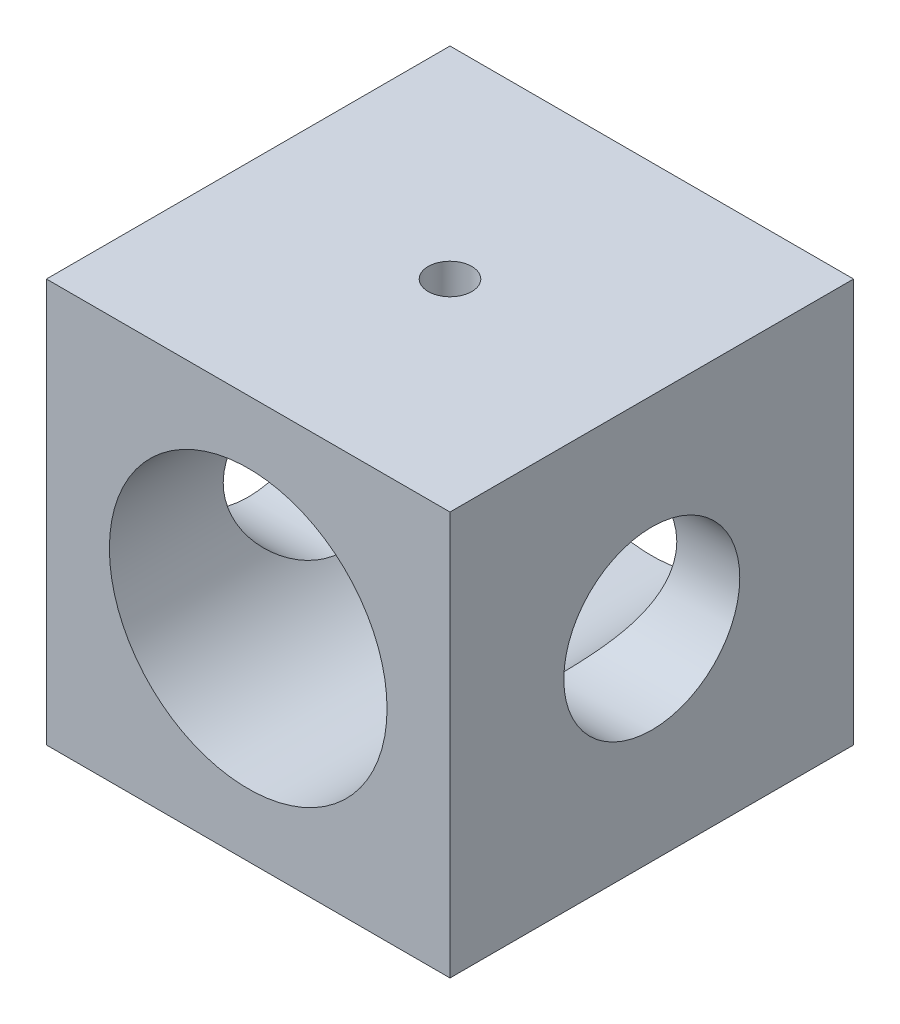
ISO-10303-21;
HEADER;
FILE_DESCRIPTION(('STEP AP214'),'2;1');
FILE_NAME('part.step','',(''),(''),'','','');
FILE_SCHEMA(('AUTOMOTIVE_DESIGN { 1 0 10303 214 1 1 1 1 }'));
ENDSEC;
DATA;
#1=APPLICATION_CONTEXT('core data for automotive mechanical design processes');
#2=APPLICATION_PROTOCOL_DEFINITION('international standard','automotive_design',2000,#1);
#3=PRODUCT_CONTEXT('',#1,'mechanical');
#4=PRODUCT('Part','Part','',(#3));
#5=PRODUCT_RELATED_PRODUCT_CATEGORY('part','',(#4));
#6=PRODUCT_DEFINITION_FORMATION('','',#4);
#7=PRODUCT_DEFINITION_CONTEXT('part definition',#1,'design');
#8=PRODUCT_DEFINITION('design','',#6,#7);
#9=PRODUCT_DEFINITION_SHAPE('','',#8);
#10=(LENGTH_UNIT() NAMED_UNIT(*) SI_UNIT(.MILLI.,.METRE.));
#11=(NAMED_UNIT(*) PLANE_ANGLE_UNIT() SI_UNIT($,.RADIAN.));
#12=(NAMED_UNIT(*) SI_UNIT($,.STERADIAN.) SOLID_ANGLE_UNIT());
#13=UNCERTAINTY_MEASURE_WITH_UNIT(LENGTH_MEASURE(1.E-05),#10,'distance_accuracy_value','');
#14=(GEOMETRIC_REPRESENTATION_CONTEXT(3) GLOBAL_UNCERTAINTY_ASSIGNED_CONTEXT((#13)) GLOBAL_UNIT_ASSIGNED_CONTEXT((#10,
#11,#12)) REPRESENTATION_CONTEXT('',''));
#15=CARTESIAN_POINT('',(0.,0.,0.));
#16=DIRECTION('',(0.,0.,1.));
#17=DIRECTION('',(1.,0.,0.));
#18=AXIS2_PLACEMENT_3D('',#15,#16,#17);
#19=CARTESIAN_POINT('',(12.5,25.,12.5));
#20=DIRECTION('',(-1.,0.,0.));
#21=DIRECTION('',(0.,0.,1.));
#22=AXIS2_PLACEMENT_3D('',#19,#20,#21);
#23=PLANE('',#22);
#24=CARTESIAN_POINT('',(12.5,12.5,0.));
#25=DIRECTION('',(-1.,0.,0.));
#26=DIRECTION('',(0.,0.,1.));
#27=AXIS2_PLACEMENT_3D('',#24,#25,#26);
#28=CIRCLE('',#27,5.45);
#29=CARTESIAN_POINT('',(12.5,12.5,5.45));
#30=VERTEX_POINT('',#29);
#31=EDGE_CURVE('E135',#30,#30,#28,.T.);
#32=ORIENTED_EDGE('',*,*,#31,.T.);
#33=EDGE_LOOP('',(#32));
#34=FACE_BOUND('',#33,.T.);
#35=DIRECTION('',(0.,0.,-1.));
#36=VECTOR('',#35,1.);
#37=CARTESIAN_POINT('',(12.5,0.,12.5));
#38=LINE('',#37,#36);
#39=CARTESIAN_POINT('',(12.5,0.,12.5));
#40=VERTEX_POINT('',#39);
#41=CARTESIAN_POINT('',(12.5,0.,-12.5));
#42=VERTEX_POINT('',#41);
#43=EDGE_CURVE('E115',#40,#42,#38,.T.);
#44=ORIENTED_EDGE('',*,*,#43,.T.);
#45=DIRECTION('',(0.,-1.,0.));
#46=VECTOR('',#45,1.);
#47=CARTESIAN_POINT('',(12.5,25.,-12.5));
#48=LINE('',#47,#46);
#49=CARTESIAN_POINT('',(12.5,25.,-12.5));
#50=VERTEX_POINT('',#49);
#51=EDGE_CURVE('E11',#50,#42,#48,.T.);
#52=ORIENTED_EDGE('',*,*,#51,.F.);
#53=DIRECTION('',(0.,0.,-1.));
#54=VECTOR('',#53,1.);
#55=CARTESIAN_POINT('',(12.5,25.,12.5));
#56=LINE('',#55,#54);
#57=CARTESIAN_POINT('',(12.5,25.,12.5));
#58=VERTEX_POINT('',#57);
#59=EDGE_CURVE('E98',#58,#50,#56,.T.);
#60=ORIENTED_EDGE('',*,*,#59,.F.);
#61=DIRECTION('',(0.,-1.,0.));
#62=VECTOR('',#61,1.);
#63=CARTESIAN_POINT('',(12.5,25.,12.5));
#64=LINE('',#63,#62);
#65=EDGE_CURVE('E111',#58,#40,#64,.T.);
#66=ORIENTED_EDGE('',*,*,#65,.T.);
#67=EDGE_LOOP('',(#44,#52,#60,#66));
#68=FACE_BOUND('',#67,.T.);
#69=ADVANCED_FACE('F39',(#34,#68),#23,.F.);
#70=CARTESIAN_POINT('',(-12.5,25.,-12.5));
#71=DIRECTION('',(0.,0.,1.));
#72=DIRECTION('',(1.,0.,0.));
#73=AXIS2_PLACEMENT_3D('',#70,#71,#72);
#74=PLANE('',#73);
#75=CARTESIAN_POINT('',(0.,12.5,-12.5));
#76=DIRECTION('',(0.,0.,1.));
#77=DIRECTION('',(1.,0.,0.));
#78=AXIS2_PLACEMENT_3D('',#75,#76,#77);
#79=CIRCLE('',#78,8.6);
#80=CARTESIAN_POINT('',(8.6,12.5,-12.5));
#81=VERTEX_POINT('',#80);
#82=EDGE_CURVE('E119',#81,#81,#79,.F.);
#83=ORIENTED_EDGE('',*,*,#82,.F.);
#84=EDGE_LOOP('',(#83));
#85=FACE_BOUND('',#84,.T.);
#86=DIRECTION('',(-1.,0.,0.));
#87=VECTOR('',#86,1.);
#88=CARTESIAN_POINT('',(-12.5,0.,-12.5));
#89=LINE('',#88,#87);
#90=CARTESIAN_POINT('',(-12.5,0.,-12.5));
#91=VERTEX_POINT('',#90);
#92=EDGE_CURVE('E103',#42,#91,#89,.T.);
#93=ORIENTED_EDGE('',*,*,#92,.T.);
#94=DIRECTION('',(0.,-1.,0.));
#95=VECTOR('',#94,1.);
#96=CARTESIAN_POINT('',(-12.5,25.,-12.5));
#97=LINE('',#96,#95);
#98=CARTESIAN_POINT('',(-12.5,25.,-12.5));
#99=VERTEX_POINT('',#98);
#100=EDGE_CURVE('E54',#99,#91,#97,.T.);
#101=ORIENTED_EDGE('',*,*,#100,.F.);
#102=DIRECTION('',(-1.,0.,0.));
#103=VECTOR('',#102,1.);
#104=CARTESIAN_POINT('',(-12.5,25.,-12.5));
#105=LINE('',#104,#103);
#106=EDGE_CURVE('E93',#50,#99,#105,.T.);
#107=ORIENTED_EDGE('',*,*,#106,.F.);
#108=ORIENTED_EDGE('',*,*,#51,.T.);
#109=EDGE_LOOP('',(#93,#101,#107,#108));
#110=FACE_BOUND('',#109,.T.);
#111=ADVANCED_FACE('F102',(#85,#110),#74,.F.);
#112=CARTESIAN_POINT('',(-12.5,25.,12.5));
#113=DIRECTION('',(1.,0.,0.));
#114=DIRECTION('',(0.,0.,-1.));
#115=AXIS2_PLACEMENT_3D('',#112,#113,#114);
#116=PLANE('',#115);
#117=CARTESIAN_POINT('',(-12.5,12.5,0.));
#118=DIRECTION('',(-1.,0.,0.));
#119=DIRECTION('',(0.,0.,1.));
#120=AXIS2_PLACEMENT_3D('',#117,#118,#119);
#121=CIRCLE('',#120,5.45);
#122=CARTESIAN_POINT('',(-12.5,12.5,5.45));
#123=VERTEX_POINT('',#122);
#124=EDGE_CURVE('E160',#123,#123,#121,.T.);
#125=ORIENTED_EDGE('',*,*,#124,.F.);
#126=EDGE_LOOP('',(#125));
#127=FACE_BOUND('',#126,.T.);
#128=DIRECTION('',(0.,0.,1.));
#129=VECTOR('',#128,1.);
#130=CARTESIAN_POINT('',(-12.5,0.,12.5));
#131=LINE('',#130,#129);
#132=CARTESIAN_POINT('',(-12.5,0.,12.5));
#133=VERTEX_POINT('',#132);
#134=EDGE_CURVE('E80',#91,#133,#131,.T.);
#135=ORIENTED_EDGE('',*,*,#134,.T.);
#136=DIRECTION('',(0.,-1.,0.));
#137=VECTOR('',#136,1.);
#138=CARTESIAN_POINT('',(-12.5,25.,12.5));
#139=LINE('',#138,#137);
#140=CARTESIAN_POINT('',(-12.5,25.,12.5));
#141=VERTEX_POINT('',#140);
#142=EDGE_CURVE('E105',#141,#133,#139,.T.);
#143=ORIENTED_EDGE('',*,*,#142,.F.);
#144=DIRECTION('',(0.,0.,1.));
#145=VECTOR('',#144,1.);
#146=CARTESIAN_POINT('',(-12.5,25.,12.5));
#147=LINE('',#146,#145);
#148=EDGE_CURVE('E96',#99,#141,#147,.T.);
#149=ORIENTED_EDGE('',*,*,#148,.F.);
#150=ORIENTED_EDGE('',*,*,#100,.T.);
#151=EDGE_LOOP('',(#135,#143,#149,#150));
#152=FACE_BOUND('',#151,.T.);
#153=ADVANCED_FACE('F107',(#127,#152),#116,.F.);
#154=CARTESIAN_POINT('',(-12.5,25.,12.5));
#155=DIRECTION('',(0.,0.,-1.));
#156=DIRECTION('',(-1.,0.,0.));
#157=AXIS2_PLACEMENT_3D('',#154,#155,#156);
#158=PLANE('',#157);
#159=CARTESIAN_POINT('',(0.,12.5,12.5));
#160=DIRECTION('',(0.,0.,1.));
#161=DIRECTION('',(1.,0.,0.));
#162=AXIS2_PLACEMENT_3D('',#159,#160,#161);
#163=CIRCLE('',#162,8.6);
#164=CARTESIAN_POINT('',(8.6,12.5,12.5));
#165=VERTEX_POINT('',#164);
#166=EDGE_CURVE('E165',#165,#165,#163,.T.);
#167=ORIENTED_EDGE('',*,*,#166,.F.);
#168=EDGE_LOOP('',(#167));
#169=FACE_BOUND('',#168,.T.);
#170=DIRECTION('',(1.,0.,0.));
#171=VECTOR('',#170,1.);
#172=CARTESIAN_POINT('',(-12.5,0.,12.5));
#173=LINE('',#172,#171);
#174=EDGE_CURVE('E86',#133,#40,#173,.T.);
#175=ORIENTED_EDGE('',*,*,#174,.T.);
#176=ORIENTED_EDGE('',*,*,#65,.F.);
#177=DIRECTION('',(1.,0.,0.));
#178=VECTOR('',#177,1.);
#179=CARTESIAN_POINT('',(-12.5,25.,12.5));
#180=LINE('',#179,#178);
#181=EDGE_CURVE('E63',#141,#58,#180,.T.);
#182=ORIENTED_EDGE('',*,*,#181,.F.);
#183=ORIENTED_EDGE('',*,*,#142,.T.);
#184=EDGE_LOOP('',(#175,#176,#182,#183));
#185=FACE_BOUND('',#184,.T.);
#186=ADVANCED_FACE('F183',(#169,#185),#158,.F.);
#187=CARTESIAN_POINT('',(0.,25.,0.));
#188=DIRECTION('',(0.,-1.,0.));
#189=DIRECTION('',(0.,0.,-1.));
#190=AXIS2_PLACEMENT_3D('',#187,#188,#189);
#191=PLANE('',#190);
#192=CARTESIAN_POINT('',(0.,25.,0.));
#193=DIRECTION('',(0.,1.,0.));
#194=DIRECTION('',(0.,0.,1.));
#195=AXIS2_PLACEMENT_3D('',#192,#193,#194);
#196=CIRCLE('',#195,1.35);
#197=CARTESIAN_POINT('',(0.,25.,1.35));
#198=VERTEX_POINT('',#197);
#199=EDGE_CURVE('E159',#198,#198,#196,.T.);
#200=ORIENTED_EDGE('',*,*,#199,.F.);
#201=EDGE_LOOP('',(#200));
#202=FACE_BOUND('',#201,.T.);
#203=ORIENTED_EDGE('',*,*,#59,.T.);
#204=ORIENTED_EDGE('',*,*,#106,.T.);
#205=ORIENTED_EDGE('',*,*,#148,.T.);
#206=ORIENTED_EDGE('',*,*,#181,.T.);
#207=EDGE_LOOP('',(#203,#204,#205,#206));
#208=FACE_BOUND('',#207,.T.);
#209=ADVANCED_FACE('F94',(#202,#208),#191,.F.);
#210=CARTESIAN_POINT('',(0.,0.,0.));
#211=DIRECTION('',(0.,-1.,0.));
#212=DIRECTION('',(0.,0.,-1.));
#213=AXIS2_PLACEMENT_3D('',#210,#211,#212);
#214=PLANE('',#213);
#215=ORIENTED_EDGE('',*,*,#43,.F.);
#216=ORIENTED_EDGE('',*,*,#174,.F.);
#217=ORIENTED_EDGE('',*,*,#134,.F.);
#218=ORIENTED_EDGE('',*,*,#92,.F.);
#219=EDGE_LOOP('',(#215,#216,#217,#218));
#220=FACE_BOUND('',#219,.T.);
#221=ADVANCED_FACE('F200',(#220),#214,.T.);
#222=CARTESIAN_POINT('',(0.,12.5,-12.501));
#223=DIRECTION('',(0.,0.,1.));
#224=DIRECTION('',(1.,0.,0.));
#225=AXIS2_PLACEMENT_3D('',#222,#223,#224);
#226=CYLINDRICAL_SURFACE('',#225,8.6);
#227=CARTESIAN_POINT('',(8.6,12.5,-5.45));
#228=CARTESIAN_POINT('',(8.60000026059588,12.6381819727184,-5.45000030960402));
#229=CARTESIAN_POINT('',(8.59666263472631,12.7763610984669,-5.44473822844661));
#230=CARTESIAN_POINT('',(8.58339519738804,13.0516563456648,-5.42376613576041));
#231=CARTESIAN_POINT('',(8.57346287323861,13.188772041778,-5.40805214188928));
#232=CARTESIAN_POINT('',(8.54723491973081,13.4609876885117,-5.36637558687615));
#233=CARTESIAN_POINT('',(8.53093145547138,13.5960849437601,-5.34040040662413));
#234=CARTESIAN_POINT('',(8.49234831368158,13.8631722425802,-5.27854747430992));
#235=CARTESIAN_POINT('',(8.47006611627797,13.9951609504097,-5.24266554663823));
#236=CARTESIAN_POINT('',(8.42017364691631,14.2544238398042,-5.1616700532189));
#237=CARTESIAN_POINT('',(8.39259292747517,14.3817197084097,-5.11660761120174));
#238=CARTESIAN_POINT('',(8.33261887982257,14.631669136972,-5.01762694267048));
#239=CARTESIAN_POINT('',(8.30022368773239,14.7543208758185,-4.96370528553603));
#240=CARTESIAN_POINT('',(8.19681557559339,15.1142614953876,-4.78947597696396));
#241=CARTESIAN_POINT('',(8.11952417939683,15.3438152390756,-4.65661539129025));
#242=CARTESIAN_POINT('',(7.94726035682808,15.7961205509758,-4.34958617548651));
#243=CARTESIAN_POINT('',(7.85136298633016,16.0168159822464,-4.17294371555769));
#244=CARTESIAN_POINT('',(7.65417079172085,16.4275390708996,-3.78893909727612));
#245=CARTESIAN_POINT('',(7.55286872534489,16.6175241302193,-3.58153502110121));
#246=CARTESIAN_POINT('',(7.3963269597735,16.8894634292399,-3.23430974019213));
#247=CARTESIAN_POINT('',(7.33999156946287,16.9827691318139,-3.10372394464859));
#248=CARTESIAN_POINT('',(7.23007361978628,17.1579748413829,-2.83401970345649));
#249=CARTESIAN_POINT('',(7.17649159956071,17.2398726199102,-2.694899598307));
#250=CARTESIAN_POINT('',(7.02283283428431,17.4672090969932,-2.26578781288139));
#251=CARTESIAN_POINT('',(6.92951399839991,17.5948354379415,-1.96335394461144));
#252=CARTESIAN_POINT('',(6.79801847925721,17.7683606580463,-1.41628317054793));
#253=CARTESIAN_POINT('',(6.75177968776579,17.8269616027935,-1.1776186111394));
#254=CARTESIAN_POINT('',(6.70103922753984,17.8904313247878,-0.813019654026826));
#255=CARTESIAN_POINT('',(6.68722993409268,17.9075146091353,-0.690420891181427));
#256=CARTESIAN_POINT('',(6.66628468024099,17.933317805911,-0.44375394035193));
#257=CARTESIAN_POINT('',(6.65914880138935,17.9420376161328,-0.319685734429171));
#258=CARTESIAN_POINT('',(6.65183849868508,17.9509700989226,-0.0706770111434215));
#259=CARTESIAN_POINT('',(6.6516844304589,17.9511578962184,0.0542649948219396));
#260=CARTESIAN_POINT('',(6.65839151577257,17.9429633768806,0.303675903971571));
#261=CARTESIAN_POINT('',(6.66525270506237,17.9345810165732,0.428144804741639));
#262=CARTESIAN_POINT('',(6.68572229322534,17.9093788963967,0.675727201519115));
#263=CARTESIAN_POINT('',(6.69933413288639,17.8925548337638,0.798839973566804));
#264=CARTESIAN_POINT('',(6.73278196072131,17.850734106368,1.04282850058634));
#265=CARTESIAN_POINT('',(6.75262052958038,17.8257340528625,1.16370330599004));
#266=CARTESIAN_POINT('',(6.81923172287831,17.7405363824457,1.51534606151636));
#267=CARTESIAN_POINT('',(6.87374811008171,17.6693942760619,1.74210214035078));
#268=CARTESIAN_POINT('',(6.99775517969415,17.500236810842,2.18072894015593));
#269=CARTESIAN_POINT('',(7.06725110763314,17.4022120349598,2.39259441218776));
#270=CARTESIAN_POINT('',(7.22941626509376,17.1605238326765,2.83865883047908));
#271=CARTESIAN_POINT('',(7.32397729066636,17.0117218593961,3.06941144754649));
#272=CARTESIAN_POINT('',(7.46867486822066,16.764747162276,3.39604423848885));
#273=CARTESIAN_POINT('',(7.51742320778058,16.6783823373446,3.50174857460629));
#274=CARTESIAN_POINT('',(7.6149218805783,16.4979329771765,3.70643204703514));
#275=CARTESIAN_POINT('',(7.6636722126318,16.4038470732571,3.80540998527714));
#276=CARTESIAN_POINT('',(7.76866152218832,16.1911144666111,4.01297433501972));
#277=CARTESIAN_POINT('',(7.82471654888031,16.0710523041426,4.12020714812513));
#278=CARTESIAN_POINT('',(7.93400178017477,15.8211749577097,4.32415211575563));
#279=CARTESIAN_POINT('',(7.98723298934929,15.6913632823752,4.42086802469571));
#280=CARTESIAN_POINT('',(8.08950180525372,15.4224406353606,4.60306690725755));
#281=CARTESIAN_POINT('',(8.13853805141391,15.2833266724992,4.6885462412617));
#282=CARTESIAN_POINT('',(8.23101106971141,14.9966223414064,4.84728819678372));
#283=CARTESIAN_POINT('',(8.27445128690652,14.8490372698942,4.92055834282297));
#284=CARTESIAN_POINT('',(8.35250659319581,14.5537267883508,5.05068708621454));
#285=CARTESIAN_POINT('',(8.38745128307841,14.4063673343383,5.10817689888203));
#286=CARTESIAN_POINT('',(8.45012648765192,14.1058933099281,5.21044826068323));
#287=CARTESIAN_POINT('',(8.47786116444031,13.9527821185044,5.25523714299819));
#288=CARTESIAN_POINT('',(8.52526135039806,13.6421793015907,5.33136643200751));
#289=CARTESIAN_POINT('',(8.5449346187078,13.4846920447626,5.36271977180651));
#290=CARTESIAN_POINT('',(8.57560151698707,13.1667444306853,5.41145108132297));
#291=CARTESIAN_POINT('',(8.58659673132157,13.0062846216168,5.42883160208916));
#292=CARTESIAN_POINT('',(8.59855161301961,12.7087520324726,5.44771780769305));
#293=CARTESIAN_POINT('',(8.6007884994513,12.5718540343237,5.45124416421489));
#294=CARTESIAN_POINT('',(8.59872087803307,12.2982337843685,5.44798162599421));
#295=CARTESIAN_POINT('',(8.59441684469751,12.1615115205335,5.44119347952256));
#296=CARTESIAN_POINT('',(8.57937448835055,11.8893355666826,5.41740259682389));
#297=CARTESIAN_POINT('',(8.56863682816332,11.753881747445,5.40040091284572));
#298=CARTESIAN_POINT('',(8.54098998052821,11.4852461767258,5.35642619986031));
#299=CARTESIAN_POINT('',(8.52408070400276,11.3520644580673,5.32945302693028));
#300=CARTESIAN_POINT('',(8.48538072695237,11.0948475710175,5.26732853176891));
#301=CARTESIAN_POINT('',(8.4638451410192,10.9706710416063,5.23260184974016));
#302=CARTESIAN_POINT('',(8.4159490365007,10.7259142794389,5.15476795551413));
#303=CARTESIAN_POINT('',(8.38958698794657,10.6053352011953,5.11165808561075));
#304=CARTESIAN_POINT('',(8.30401759789278,10.2500000961834,4.97039961538301));
#305=CARTESIAN_POINT('',(8.23829611294517,10.0214487070953,4.86027369192199));
#306=CARTESIAN_POINT('',(8.08697520543695,9.56319733349914,4.59935566337685));
#307=CARTESIAN_POINT('',(8.00004969165067,9.33563859578985,4.44561059131092));
#308=CARTESIAN_POINT('',(7.81738789254707,8.90798157439503,4.10782916979699));
#309=CARTESIAN_POINT('',(7.72164215891503,8.70791332387668,3.9237601667201));
#310=CARTESIAN_POINT('',(7.51397712939154,8.30980206885375,3.49882653217796));
#311=CARTESIAN_POINT('',(7.40178386673726,8.11655344546487,3.25358439264222));
#312=CARTESIAN_POINT('',(7.18730970794229,7.77310360393113,2.73069930496311));
#313=CARTESIAN_POINT('',(7.08502342825998,7.62287891835264,2.45307413691001));
#314=CARTESIAN_POINT('',(6.92315967166692,7.39655248735015,1.92900307179001));
#315=CARTESIAN_POINT('',(6.85912544322848,7.31156827701513,1.68783562178379));
#316=CARTESIAN_POINT('',(6.78039636325345,7.20962738038541,1.31568619473719));
#317=CARTESIAN_POINT('',(6.75704368153713,7.17990679449017,1.18993275188723));
#318=CARTESIAN_POINT('',(6.71693360789277,7.12935253857512,0.935641056041623));
#319=CARTESIAN_POINT('',(6.70017329302833,7.10851492965952,0.807104063953578));
#320=CARTESIAN_POINT('',(6.67384103338447,7.07595268192631,0.547244479798761));
#321=CARTESIAN_POINT('',(6.66431894931414,7.06429123430921,0.415908860652782));
#322=CARTESIAN_POINT('',(6.65307471804052,7.05053417270107,0.152399224985244));
#323=CARTESIAN_POINT('',(6.65135250875316,7.0484384825702,0.0202252151453454));
#324=CARTESIAN_POINT('',(6.65578818667495,7.05385503800486,-0.243817454708333));
#325=CARTESIAN_POINT('',(6.66194770225804,7.06136926899159,-0.375686045982736));
#326=CARTESIAN_POINT('',(6.68186955867017,7.08586422111339,-0.637950516935231));
#327=CARTESIAN_POINT('',(6.69563172686723,7.10284472729963,-0.768346429984543));
#328=CARTESIAN_POINT('',(6.7285532740639,7.14395738269596,-1.01459601657805));
#329=CARTESIAN_POINT('',(6.74708917083948,7.1672743091289,-1.13067124619557));
#330=CARTESIAN_POINT('',(6.78932039324243,7.22114634967227,-1.36018882485051));
#331=CARTESIAN_POINT('',(6.813017425003,7.25170385761976,-1.47363028948022));
#332=CARTESIAN_POINT('',(6.89082318148114,7.35374930517779,-1.80920487201729));
#333=CARTESIAN_POINT('',(6.95166239075519,7.43562897345116,-2.02669834835728));
#334=CARTESIAN_POINT('',(7.09471528256198,7.6376639421578,-2.47569485692013));
#335=CARTESIAN_POINT('',(7.17872758331329,7.76156819372172,-2.70491095960937));
#336=CARTESIAN_POINT('',(7.3543519322479,8.03899704467064,-3.14148966047257));
#337=CARTESIAN_POINT('',(7.4459698929154,8.19254481357988,-3.34883496699854));
#338=CARTESIAN_POINT('',(7.64915426600668,8.56253133720579,-3.78096932574753));
#339=CARTESIAN_POINT('',(7.76086877876519,8.78540567976888,-4.00027492166391));
#340=CARTESIAN_POINT('',(7.92068490743649,9.14734671577707,-4.29962773104149));
#341=CARTESIAN_POINT('',(7.97270268837833,9.27270957071798,-4.39454152607115));
#342=CARTESIAN_POINT('',(8.07291648500155,9.53228394543379,-4.57384153114296));
#343=CARTESIAN_POINT('',(8.12111206663761,9.66649646700802,-4.6582265461689));
#344=CARTESIAN_POINT('',(8.21309367766449,9.94520808360036,-4.81680791913527));
#345=CARTESIAN_POINT('',(8.25680129852834,10.0898327879895,-4.89082937431268));
#346=CARTESIAN_POINT('',(8.33768845876157,10.3865724339015,-5.02618077507539));
#347=CARTESIAN_POINT('',(8.37487173304051,10.5386830257879,-5.08751798546349));
#348=CARTESIAN_POINT('',(8.44150810966253,10.8489259143303,-5.19648080028735));
#349=CARTESIAN_POINT('',(8.47098121300559,11.0070413870849,-5.24414191375678));
#350=CARTESIAN_POINT('',(8.5213350715826,11.3281533060928,-5.32509707068431));
#351=CARTESIAN_POINT('',(8.54222185983611,11.4911462386037,-5.35840120261992));
#352=CARTESIAN_POINT('',(8.57218700617804,11.7948939762874,-5.4060310867178));
#353=CARTESIAN_POINT('',(8.58259256380042,11.9351866759635,-5.42249624331705));
#354=CARTESIAN_POINT('',(8.59649911379748,12.2169872021168,-5.44448083711708));
#355=CARTESIAN_POINT('',(8.59999973313744,12.3584950938291,-5.44999968295077));
#356=CARTESIAN_POINT('',(8.6,12.5,-5.45));
#357=B_SPLINE_CURVE_WITH_KNOTS('',3,(#227,#228,#229,#230,#231,#232,#233,#234,#235,#236,#237,
#238,#239,#240,#241,#242,#243,#244,#245,#246,#247,#248,#249,#250,#251,#252,#253,#254,#255,#256,
#257,#258,#259,#260,#261,#262,#263,#264,#265,#266,#267,#268,#269,#270,#271,#272,#273,#274,#275,
#276,#277,#278,#279,#280,#281,#282,#283,#284,#285,#286,#287,#288,#289,#290,#291,#292,#293,#294,
#295,#296,#297,#298,#299,#300,#301,#302,#303,#304,#305,#306,#307,#308,#309,#310,#311,#312,#313,
#314,#315,#316,#317,#318,#319,#320,#321,#322,#323,#324,#325,#326,#327,#328,#329,#330,#331,#332,
#333,#334,#335,#336,#337,#338,#339,#340,#341,#342,#343,#344,#345,#346,#347,#348,#349,#350,#351,
#352,#353,#354,#355,#356),.UNSPECIFIED.,.T.,.F.,(4,2,2,2,2,2,2,2,2,2,2,2,2,2,2,2,2,2,2,2,2,2,2,
2,2,2,2,2,2,2,2,2,2,2,2,2,2,2,2,2,2,2,2,2,2,2,2,2,2,2,2,2,2,2,2,2,2,2,2,2,2,2,2,2,4),(0.,
0.414401772924397,0.828961529927691,1.24403270370335,1.65927909422361,2.07227337446245,
2.4854279601511,3.31085172458377,4.20311714787922,5.09660979622363,5.60632819707397,
6.11614602905233,7.13300038593069,7.87989177259328,8.25313251010221,8.6263778087641,
9.00071124271866,9.37504658429649,9.74957291996022,10.1242546845275,10.8527471826032,
11.5814951995599,12.4492219334998,12.8837752887294,13.3184058424703,13.8291640976557,
14.339739415185,14.8504797068177,15.3609040556417,15.8461529078595,16.3311210171132,
16.8156212397839,17.300032986068,17.7103901848633,18.1207176155076,18.5310027794503,
18.941293865447,19.3330444095357,19.7249193526283,20.5080588585866,21.3689937373962,
22.2308618277516,23.2218580594224,24.2123127176042,24.9996882236836,25.393199267604,
25.7865356386257,26.1825575579658,26.5785763251145,26.9746769234333,27.370768527941,
27.729898604985,28.0891475815093,28.8073103672184,29.6257919267967,30.4449158248413,
31.4360876703717,31.9324651862535,32.4288989898169,32.9328995559184,33.4366106551991,
33.9390018181344,34.4410393791334,34.8653835617946,35.2897506687412),.UNSPECIFIED.);
#358=CARTESIAN_POINT('',(8.6,12.5,-5.45));
#359=VERTEX_POINT('',#358);
#360=EDGE_CURVE('E42',#359,#359,#357,.T.);
#361=ORIENTED_EDGE('',*,*,#360,.T.);
#362=EDGE_LOOP('',(#361));
#363=FACE_BOUND('',#362,.T.);
#364=CARTESIAN_POINT('',(-8.6,12.5,5.45));
#365=CARTESIAN_POINT('',(-8.60000026059588,12.6381819727184,5.45000030960402));
#366=CARTESIAN_POINT('',(-8.59666263472631,12.7763610984669,5.44473822844661));
#367=CARTESIAN_POINT('',(-8.58339519738804,13.0516563456648,5.42376613576041));
#368=CARTESIAN_POINT('',(-8.57346287323861,13.188772041778,5.40805214188928));
#369=CARTESIAN_POINT('',(-8.54723491973081,13.4609876885117,5.36637558687615));
#370=CARTESIAN_POINT('',(-8.53093145547138,13.5960849437601,5.34040040662413));
#371=CARTESIAN_POINT('',(-8.49234831368158,13.8631722425802,5.27854747430992));
#372=CARTESIAN_POINT('',(-8.47006611627797,13.9951609504097,5.24266554663823));
#373=CARTESIAN_POINT('',(-8.42017364691631,14.2544238398042,5.1616700532189));
#374=CARTESIAN_POINT('',(-8.39259292747517,14.3817197084097,5.11660761120174));
#375=CARTESIAN_POINT('',(-8.33261887982257,14.631669136972,5.01762694267048));
#376=CARTESIAN_POINT('',(-8.30022368773239,14.7543208758185,4.96370528553603));
#377=CARTESIAN_POINT('',(-8.19681557559339,15.1142614953876,4.78947597696396));
#378=CARTESIAN_POINT('',(-8.11952417939683,15.3438152390756,4.65661539129025));
#379=CARTESIAN_POINT('',(-7.94726035682808,15.7961205509758,4.34958617548651));
#380=CARTESIAN_POINT('',(-7.85136298633016,16.0168159822464,4.17294371555769));
#381=CARTESIAN_POINT('',(-7.65417079172085,16.4275390708996,3.78893909727612));
#382=CARTESIAN_POINT('',(-7.55286872534489,16.6175241302193,3.58153502110121));
#383=CARTESIAN_POINT('',(-7.3963269597735,16.8894634292399,3.23430974019213));
#384=CARTESIAN_POINT('',(-7.33999156946287,16.9827691318139,3.10372394464859));
#385=CARTESIAN_POINT('',(-7.23007361978628,17.1579748413829,2.83401970345649));
#386=CARTESIAN_POINT('',(-7.17649159956071,17.2398726199102,2.694899598307));
#387=CARTESIAN_POINT('',(-7.02283283428431,17.4672090969932,2.26578781288139));
#388=CARTESIAN_POINT('',(-6.92951399839991,17.5948354379415,1.96335394461144));
#389=CARTESIAN_POINT('',(-6.79801847925721,17.7683606580463,1.41628317054793));
#390=CARTESIAN_POINT('',(-6.75177968776579,17.8269616027935,1.1776186111394));
#391=CARTESIAN_POINT('',(-6.70103922753984,17.8904313247878,0.813019654026826));
#392=CARTESIAN_POINT('',(-6.68722993409268,17.9075146091353,0.690420891181427));
#393=CARTESIAN_POINT('',(-6.66628468024099,17.933317805911,0.44375394035193));
#394=CARTESIAN_POINT('',(-6.65914880138935,17.9420376161328,0.319685734429171));
#395=CARTESIAN_POINT('',(-6.65183849868508,17.9509700989226,0.0706770111434215));
#396=CARTESIAN_POINT('',(-6.6516844304589,17.9511578962184,-0.0542649948219396));
#397=CARTESIAN_POINT('',(-6.65839151577257,17.9429633768806,-0.303675903971571));
#398=CARTESIAN_POINT('',(-6.66525270506237,17.9345810165732,-0.428144804741639));
#399=CARTESIAN_POINT('',(-6.68572229322534,17.9093788963967,-0.675727201519115));
#400=CARTESIAN_POINT('',(-6.69933413288639,17.8925548337638,-0.798839973566804));
#401=CARTESIAN_POINT('',(-6.73278196072131,17.850734106368,-1.04282850058634));
#402=CARTESIAN_POINT('',(-6.75262052958038,17.8257340528625,-1.16370330599004));
#403=CARTESIAN_POINT('',(-6.81923172287831,17.7405363824457,-1.51534606151636));
#404=CARTESIAN_POINT('',(-6.87374811008171,17.6693942760619,-1.74210214035078));
#405=CARTESIAN_POINT('',(-6.99775517969415,17.500236810842,-2.18072894015593));
#406=CARTESIAN_POINT('',(-7.06725110763314,17.4022120349598,-2.39259441218776));
#407=CARTESIAN_POINT('',(-7.22941626509376,17.1605238326765,-2.83865883047908));
#408=CARTESIAN_POINT('',(-7.32397729066636,17.0117218593961,-3.06941144754649));
#409=CARTESIAN_POINT('',(-7.46867486822066,16.764747162276,-3.39604423848885));
#410=CARTESIAN_POINT('',(-7.51742320778058,16.6783823373446,-3.50174857460629));
#411=CARTESIAN_POINT('',(-7.6149218805783,16.4979329771765,-3.70643204703514));
#412=CARTESIAN_POINT('',(-7.6636722126318,16.4038470732571,-3.80540998527714));
#413=CARTESIAN_POINT('',(-7.76866152218832,16.1911144666111,-4.01297433501972));
#414=CARTESIAN_POINT('',(-7.82471654888031,16.0710523041426,-4.12020714812513));
#415=CARTESIAN_POINT('',(-7.93400178017477,15.8211749577097,-4.32415211575563));
#416=CARTESIAN_POINT('',(-7.98723298934929,15.6913632823752,-4.42086802469571));
#417=CARTESIAN_POINT('',(-8.08950180525372,15.4224406353606,-4.60306690725755));
#418=CARTESIAN_POINT('',(-8.13853805141391,15.2833266724992,-4.6885462412617));
#419=CARTESIAN_POINT('',(-8.23101106971141,14.9966223414064,-4.84728819678372));
#420=CARTESIAN_POINT('',(-8.27445128690652,14.8490372698942,-4.92055834282297));
#421=CARTESIAN_POINT('',(-8.35250659319581,14.5537267883508,-5.05068708621454));
#422=CARTESIAN_POINT('',(-8.38745128307841,14.4063673343383,-5.10817689888203));
#423=CARTESIAN_POINT('',(-8.45012648765192,14.1058933099281,-5.21044826068323));
#424=CARTESIAN_POINT('',(-8.47786116444031,13.9527821185044,-5.25523714299819));
#425=CARTESIAN_POINT('',(-8.52526135039806,13.6421793015907,-5.33136643200751));
#426=CARTESIAN_POINT('',(-8.5449346187078,13.4846920447626,-5.36271977180651));
#427=CARTESIAN_POINT('',(-8.57560151698707,13.1667444306853,-5.41145108132297));
#428=CARTESIAN_POINT('',(-8.58659673132157,13.0062846216168,-5.42883160208916));
#429=CARTESIAN_POINT('',(-8.59855161301961,12.7087520324726,-5.44771780769305));
#430=CARTESIAN_POINT('',(-8.6007884994513,12.5718540343237,-5.45124416421489));
#431=CARTESIAN_POINT('',(-8.59872087803307,12.2982337843685,-5.44798162599421));
#432=CARTESIAN_POINT('',(-8.59441684469751,12.1615115205335,-5.44119347952256));
#433=CARTESIAN_POINT('',(-8.57937448835055,11.8893355666826,-5.41740259682389));
#434=CARTESIAN_POINT('',(-8.56863682816332,11.753881747445,-5.40040091284572));
#435=CARTESIAN_POINT('',(-8.54098998052821,11.4852461767258,-5.35642619986031));
#436=CARTESIAN_POINT('',(-8.52408070400276,11.3520644580673,-5.32945302693028));
#437=CARTESIAN_POINT('',(-8.48538072695237,11.0948475710175,-5.26732853176891));
#438=CARTESIAN_POINT('',(-8.4638451410192,10.9706710416063,-5.23260184974016));
#439=CARTESIAN_POINT('',(-8.4159490365007,10.7259142794389,-5.15476795551413));
#440=CARTESIAN_POINT('',(-8.38958698794657,10.6053352011953,-5.11165808561075));
#441=CARTESIAN_POINT('',(-8.30401759789278,10.2500000961834,-4.97039961538301));
#442=CARTESIAN_POINT('',(-8.23829611294517,10.0214487070953,-4.86027369192199));
#443=CARTESIAN_POINT('',(-8.08697520543695,9.56319733349914,-4.59935566337685));
#444=CARTESIAN_POINT('',(-8.00004969165067,9.33563859578985,-4.44561059131092));
#445=CARTESIAN_POINT('',(-7.81738789254707,8.90798157439503,-4.10782916979699));
#446=CARTESIAN_POINT('',(-7.72164215891503,8.70791332387668,-3.9237601667201));
#447=CARTESIAN_POINT('',(-7.51397712939154,8.30980206885375,-3.49882653217796));
#448=CARTESIAN_POINT('',(-7.40178386673726,8.11655344546487,-3.25358439264222));
#449=CARTESIAN_POINT('',(-7.18730970794229,7.77310360393113,-2.73069930496311));
#450=CARTESIAN_POINT('',(-7.08502342825998,7.62287891835264,-2.45307413691001));
#451=CARTESIAN_POINT('',(-6.92315967166692,7.39655248735015,-1.92900307179001));
#452=CARTESIAN_POINT('',(-6.85912544322848,7.31156827701513,-1.68783562178379));
#453=CARTESIAN_POINT('',(-6.78039636325345,7.20962738038541,-1.31568619473719));
#454=CARTESIAN_POINT('',(-6.75704368153713,7.17990679449017,-1.18993275188723));
#455=CARTESIAN_POINT('',(-6.71693360789277,7.12935253857512,-0.935641056041623));
#456=CARTESIAN_POINT('',(-6.70017329302833,7.10851492965952,-0.807104063953578));
#457=CARTESIAN_POINT('',(-6.67384103338447,7.07595268192631,-0.547244479798761));
#458=CARTESIAN_POINT('',(-6.66431894931414,7.06429123430921,-0.415908860652782));
#459=CARTESIAN_POINT('',(-6.65307471804052,7.05053417270107,-0.152399224985244));
#460=CARTESIAN_POINT('',(-6.65135250875316,7.0484384825702,-0.0202252151453454));
#461=CARTESIAN_POINT('',(-6.65578818667495,7.05385503800486,0.243817454708333));
#462=CARTESIAN_POINT('',(-6.66194770225804,7.06136926899159,0.375686045982736));
#463=CARTESIAN_POINT('',(-6.68186955867017,7.08586422111339,0.637950516935231));
#464=CARTESIAN_POINT('',(-6.69563172686723,7.10284472729963,0.768346429984543));
#465=CARTESIAN_POINT('',(-6.7285532740639,7.14395738269596,1.01459601657805));
#466=CARTESIAN_POINT('',(-6.74708917083948,7.1672743091289,1.13067124619557));
#467=CARTESIAN_POINT('',(-6.78932039324243,7.22114634967227,1.36018882485051));
#468=CARTESIAN_POINT('',(-6.813017425003,7.25170385761976,1.47363028948022));
#469=CARTESIAN_POINT('',(-6.89082318148114,7.35374930517779,1.80920487201729));
#470=CARTESIAN_POINT('',(-6.95166239075519,7.43562897345116,2.02669834835728));
#471=CARTESIAN_POINT('',(-7.09471528256198,7.6376639421578,2.47569485692013));
#472=CARTESIAN_POINT('',(-7.17872758331329,7.76156819372172,2.70491095960937));
#473=CARTESIAN_POINT('',(-7.3543519322479,8.03899704467064,3.14148966047257));
#474=CARTESIAN_POINT('',(-7.4459698929154,8.19254481357988,3.34883496699854));
#475=CARTESIAN_POINT('',(-7.64915426600668,8.56253133720579,3.78096932574753));
#476=CARTESIAN_POINT('',(-7.76086877876519,8.78540567976888,4.00027492166391));
#477=CARTESIAN_POINT('',(-7.92068490743649,9.14734671577707,4.29962773104149));
#478=CARTESIAN_POINT('',(-7.97270268837833,9.27270957071798,4.39454152607115));
#479=CARTESIAN_POINT('',(-8.07291648500155,9.53228394543379,4.57384153114296));
#480=CARTESIAN_POINT('',(-8.12111206663761,9.66649646700802,4.6582265461689));
#481=CARTESIAN_POINT('',(-8.21309367766449,9.94520808360036,4.81680791913527));
#482=CARTESIAN_POINT('',(-8.25680129852834,10.0898327879895,4.89082937431268));
#483=CARTESIAN_POINT('',(-8.33768845876157,10.3865724339015,5.02618077507539));
#484=CARTESIAN_POINT('',(-8.37487173304051,10.5386830257879,5.08751798546349));
#485=CARTESIAN_POINT('',(-8.44150810966253,10.8489259143303,5.19648080028735));
#486=CARTESIAN_POINT('',(-8.47098121300559,11.0070413870849,5.24414191375678));
#487=CARTESIAN_POINT('',(-8.5213350715826,11.3281533060928,5.32509707068431));
#488=CARTESIAN_POINT('',(-8.54222185983611,11.4911462386037,5.35840120261992));
#489=CARTESIAN_POINT('',(-8.57218700617804,11.7948939762874,5.4060310867178));
#490=CARTESIAN_POINT('',(-8.58259256380042,11.9351866759635,5.42249624331705));
#491=CARTESIAN_POINT('',(-8.59649911379748,12.2169872021168,5.44448083711708));
#492=CARTESIAN_POINT('',(-8.59999973313744,12.3584950938291,5.44999968295077));
#493=CARTESIAN_POINT('',(-8.6,12.5,5.45));
#494=B_SPLINE_CURVE_WITH_KNOTS('',3,(#364,#365,#366,#367,#368,#369,#370,#371,#372,#373,#374,
#375,#376,#377,#378,#379,#380,#381,#382,#383,#384,#385,#386,#387,#388,#389,#390,#391,#392,#393,
#394,#395,#396,#397,#398,#399,#400,#401,#402,#403,#404,#405,#406,#407,#408,#409,#410,#411,#412,
#413,#414,#415,#416,#417,#418,#419,#420,#421,#422,#423,#424,#425,#426,#427,#428,#429,#430,#431,
#432,#433,#434,#435,#436,#437,#438,#439,#440,#441,#442,#443,#444,#445,#446,#447,#448,#449,#450,
#451,#452,#453,#454,#455,#456,#457,#458,#459,#460,#461,#462,#463,#464,#465,#466,#467,#468,#469,
#470,#471,#472,#473,#474,#475,#476,#477,#478,#479,#480,#481,#482,#483,#484,#485,#486,#487,#488,
#489,#490,#491,#492,#493),.UNSPECIFIED.,.T.,.F.,(4,2,2,2,2,2,2,2,2,2,2,2,2,2,2,2,2,2,2,2,2,2,2,
2,2,2,2,2,2,2,2,2,2,2,2,2,2,2,2,2,2,2,2,2,2,2,2,2,2,2,2,2,2,2,2,2,2,2,2,2,2,2,2,2,4),(0.,
0.414401772924397,0.828961529927691,1.24403270370335,1.65927909422361,2.07227337446245,
2.4854279601511,3.31085172458377,4.20311714787922,5.09660979622363,5.60632819707397,
6.11614602905233,7.13300038593069,7.87989177259328,8.25313251010221,8.6263778087641,
9.00071124271866,9.37504658429649,9.74957291996022,10.1242546845275,10.8527471826032,
11.5814951995599,12.4492219334998,12.8837752887294,13.3184058424703,13.8291640976557,
14.339739415185,14.8504797068177,15.3609040556417,15.8461529078595,16.3311210171132,
16.8156212397839,17.300032986068,17.7103901848633,18.1207176155076,18.5310027794503,
18.941293865447,19.3330444095357,19.7249193526283,20.5080588585866,21.3689937373962,
22.2308618277516,23.2218580594224,24.2123127176042,24.9996882236836,25.393199267604,
25.7865356386257,26.1825575579658,26.5785763251145,26.9746769234333,27.370768527941,
27.729898604985,28.0891475815093,28.8073103672184,29.6257919267967,30.4449158248413,
31.4360876703717,31.9324651862535,32.4288989898169,32.9328995559184,33.4366106551991,
33.9390018181344,34.4410393791334,34.8653835617946,35.2897506687412),.UNSPECIFIED.);
#495=CARTESIAN_POINT('',(-8.6,12.5,5.45));
#496=VERTEX_POINT('',#495);
#497=EDGE_CURVE('E129',#496,#496,#494,.T.);
#498=ORIENTED_EDGE('',*,*,#497,.T.);
#499=EDGE_LOOP('',(#498));
#500=FACE_BOUND('',#499,.T.);
#501=CARTESIAN_POINT('',(0.,21.1,1.35));
#502=CARTESIAN_POINT('',(-0.0753336086911093,21.099998755396,1.34999692677055));
#503=CARTESIAN_POINT('',(-0.150709876368964,21.0989997996713,1.3436729812239));
#504=CARTESIAN_POINT('',(-0.299352611029609,21.0951109300281,1.31855236104388));
#505=CARTESIAN_POINT('',(-0.372617000777485,21.092219216495,1.29974381594253));
#506=CARTESIAN_POINT('',(-0.514863556548132,21.0848695432784,1.25023231460332));
#507=CARTESIAN_POINT('',(-0.583849019047817,21.0804128073716,1.21953865007111));
#508=CARTESIAN_POINT('',(-0.715680666125089,21.0704245656517,1.147151569854));
#509=CARTESIAN_POINT('',(-0.778527640499621,21.0648931983784,1.10545957181015));
#510=CARTESIAN_POINT('',(-0.896843821898923,21.0533173024986,1.01188092647982));
#511=CARTESIAN_POINT('',(-0.952253120395027,21.0472691826808,0.959918970034864));
#512=CARTESIAN_POINT('',(-1.05360394987208,21.0353692967497,0.847437501087735));
#513=CARTESIAN_POINT('',(-1.0995449152786,21.0295175423834,0.786917477748179));
#514=CARTESIAN_POINT('',(-1.18089102528815,21.0186381361113,0.658631581378628));
#515=CARTESIAN_POINT('',(-1.21623768136943,21.013615125543,0.590828192925029));
#516=CARTESIAN_POINT('',(-1.27501793582588,21.0050113013217,0.450154731958952));
#517=CARTESIAN_POINT('',(-1.29845224616728,21.0014304014805,0.377284962545309));
#518=CARTESIAN_POINT('',(-1.33255542604777,20.9961517383013,0.22917939718473));
#519=CARTESIAN_POINT('',(-1.34332722158084,20.9944387997955,0.153967852130035));
#520=CARTESIAN_POINT('',(-1.35211856465851,20.9930440045624,0.00278677629267837));
#521=CARTESIAN_POINT('',(-1.35013891329452,20.9933620202433,-0.0731827065742397));
#522=CARTESIAN_POINT('',(-1.33356755780718,20.995979333325,-0.222992983299291));
#523=CARTESIAN_POINT('',(-1.31909088761076,20.998260558968,-0.296846863106618));
#524=CARTESIAN_POINT('',(-1.27811669233229,21.0045190019113,-0.441064233652213));
#525=CARTESIAN_POINT('',(-1.25161879769721,21.0084962713507,-0.511427617012865));
#526=CARTESIAN_POINT('',(-1.18723591721629,21.0177184475098,-0.647014347662334));
#527=CARTESIAN_POINT('',(-1.14930259575869,21.0229687161735,-0.712214363292466));
#528=CARTESIAN_POINT('',(-1.06316002925344,21.0341415061341,-0.835367341512442));
#529=CARTESIAN_POINT('',(-1.01495004668367,21.0400640756656,-0.893319783493915));
#530=CARTESIAN_POINT('',(-0.908993122494399,21.0519938131426,-1.00099891991105));
#531=CARTESIAN_POINT('',(-0.851147360780251,21.0580011963985,-1.05062840240608));
#532=CARTESIAN_POINT('',(-0.727896656837397,21.0693634576421,-1.1394903136518));
#533=CARTESIAN_POINT('',(-0.662491675554105,21.0747183322583,-1.17872268868254));
#534=CARTESIAN_POINT('',(-0.525891978323621,21.0841786103075,-1.24568327838227));
#535=CARTESIAN_POINT('',(-0.454693305896911,21.0882831506653,-1.27340355130201));
#536=CARTESIAN_POINT('',(-0.308572365690998,21.0947731990117,-1.31646623591189));
#537=CARTESIAN_POINT('',(-0.233650374297481,21.0971588343932,-1.33180956490228));
#538=CARTESIAN_POINT('',(-0.0830481027549324,21.0999252996456,-1.34955253350329));
#539=CARTESIAN_POINT('',(-0.00738392488531126,21.1003268162669,-1.35208574009061));
#540=CARTESIAN_POINT('',(0.143288307908853,21.0991362567101,-1.34449172007949));
#541=CARTESIAN_POINT('',(0.218296385053187,21.0975442483109,-1.33436492391494));
#542=CARTESIAN_POINT('',(0.365119389920045,21.0925583152539,-1.30184944273822));
#543=CARTESIAN_POINT('',(0.436949178721975,21.0891740191396,-1.2795262591664));
#544=CARTESIAN_POINT('',(0.575846613363073,21.0809816203728,-1.22332105611505));
#545=CARTESIAN_POINT('',(0.642914017197801,21.0761734454288,-1.1894384497412));
#546=CARTESIAN_POINT('',(0.770967309701306,21.0656158408592,-1.11076587715076));
#547=CARTESIAN_POINT('',(0.831900866411621,21.0598592630055,-1.06589170883153));
#548=CARTESIAN_POINT('',(0.945420094468289,21.0480666839097,-0.966626483486754));
#549=CARTESIAN_POINT('',(0.99800523136144,21.0420306648101,-0.912234817633623));
#550=CARTESIAN_POINT('',(1.09382463454951,21.0302933749998,-0.794882130725263));
#551=CARTESIAN_POINT('',(1.13696907266935,21.0245956667668,-0.731847352925804));
#552=CARTESIAN_POINT('',(1.21205677582427,21.014244598015,-0.599346683697379));
#553=CARTESIAN_POINT('',(1.24400036559688,21.0095912072205,-0.529880978789131));
#554=CARTESIAN_POINT('',(1.2956423595551,21.0018818272403,-0.386751398988983));
#555=CARTESIAN_POINT('',(1.3153869933331,20.9988198144108,-0.313104542910669));
#556=CARTESIAN_POINT('',(1.34221708917184,20.9946242318764,-0.163488093205472));
#557=CARTESIAN_POINT('',(1.34930351651428,20.993490515125,-0.0875186771403466));
#558=CARTESIAN_POINT('',(1.35059146385143,20.9932857272954,0.0636904112360479));
#559=CARTESIAN_POINT('',(1.34493428168121,20.9941920368495,0.138928887180395));
#560=CARTESIAN_POINT('',(1.32119950303468,20.9979158563198,0.287369883634863));
#561=CARTESIAN_POINT('',(1.30312193431426,21.000733361965,0.36057240869435));
#562=CARTESIAN_POINT('',(1.2551112169119,21.0079539228581,0.502818086695083));
#563=CARTESIAN_POINT('',(1.22518887858278,21.0123555320123,0.571864966350498));
#564=CARTESIAN_POINT('',(1.15435223265227,21.0222499552638,0.703981458577989));
#565=CARTESIAN_POINT('',(1.11343748191657,21.0277428133502,0.767050830041624));
#566=CARTESIAN_POINT('',(1.02126773314674,21.0392731459518,0.886138290317726));
#567=CARTESIAN_POINT('',(0.969908358061243,21.0453157476239,0.942075108606722));
#568=CARTESIAN_POINT('',(0.858527795667306,21.0572226963832,1.04458571594098));
#569=CARTESIAN_POINT('',(0.798504604401294,21.0630870018492,1.09115733281625));
#570=CARTESIAN_POINT('',(0.671070102215248,21.0740174877746,1.17387035147922));
#571=CARTESIAN_POINT('',(0.603616204174076,21.0790786137084,1.2099468038883));
#572=CARTESIAN_POINT('',(0.463556667559936,21.0877831293134,1.27020280453595));
#573=CARTESIAN_POINT('',(0.390956368708605,21.0914279637391,1.29439448309071));
#574=CARTESIAN_POINT('',(0.265039717011044,21.0960720337241,1.32480203341608));
#575=CARTESIAN_POINT('',(0.212494543326834,21.0975373316602,1.33423655128197));
#576=CARTESIAN_POINT('',(0.106640032156377,21.0995017484496,1.3468365776599));
#577=CARTESIAN_POINT('',(0.0533307055846838,21.100000881089,1.35000217562251));
#578=CARTESIAN_POINT('',(0.,21.1,1.35));
#579=B_SPLINE_CURVE_WITH_KNOTS('',3,(#501,#502,#503,#504,#505,#506,#507,#508,#509,#510,#511,
#512,#513,#514,#515,#516,#517,#518,#519,#520,#521,#522,#523,#524,#525,#526,#527,#528,#529,#530,
#531,#532,#533,#534,#535,#536,#537,#538,#539,#540,#541,#542,#543,#544,#545,#546,#547,#548,#549,
#550,#551,#552,#553,#554,#555,#556,#557,#558,#559,#560,#561,#562,#563,#564,#565,#566,#567,#568,
#569,#570,#571,#572,#573,#574,#575,#576,#577,#578),.UNSPECIFIED.,.T.,.F.,(4,2,2,2,2,2,2,2,2,2,2,
2,2,2,2,2,2,2,2,2,2,2,2,2,2,2,2,2,2,2,2,2,2,2,2,2,2,2,4),(0.,0.225805924632518,
0.451826855671328,0.67767144068522,0.903486929450099,1.13102423667306,1.35857513150483,
1.58736006971044,1.81613133249788,2.04302990250188,2.26991421806671,2.49473208694365,
2.71955686757548,2.9453455957334,3.17115053346342,3.39943258562204,3.62771581724893,
3.85615627199688,4.08457979463743,4.31061663614428,4.53664579271824,4.76147281078372,
4.98631124545201,5.2129291245902,5.43956150561701,5.66826460939962,5.8969610820216,
6.12478547541405,6.35259249477244,6.57788609669128,6.80317919514745,7.02826714792552,
7.2533641759783,7.48083220983663,7.70835294205827,7.93725311206232,8.16591916485233,
8.32577558657987,8.4856297273158),.UNSPECIFIED.);
#580=CARTESIAN_POINT('',(0.,21.1,1.35));
#581=VERTEX_POINT('',#580);
#582=EDGE_CURVE('E151',#581,#581,#579,.T.);
#583=ORIENTED_EDGE('',*,*,#582,.F.);
#584=EDGE_LOOP('',(#583));
#585=FACE_BOUND('',#584,.T.);
#586=ORIENTED_EDGE('',*,*,#166,.T.);
#587=EDGE_LOOP('',(#586));
#588=FACE_BOUND('',#587,.T.);
#589=ORIENTED_EDGE('',*,*,#82,.T.);
#590=EDGE_LOOP('',(#589));
#591=FACE_BOUND('',#590,.T.);
#592=ADVANCED_FACE('F136',(#363,#500,#585,#588,#591),#226,.F.);
#593=CARTESIAN_POINT('',(0.,-0.001000000000001,0.));
#594=DIRECTION('',(0.,1.,0.));
#595=DIRECTION('',(0.,0.,1.));
#596=AXIS2_PLACEMENT_3D('',#593,#594,#595);
#597=CYLINDRICAL_SURFACE('',#596,1.35);
#598=ORIENTED_EDGE('',*,*,#199,.T.);
#599=EDGE_LOOP('',(#598));
#600=FACE_BOUND('',#599,.T.);
#601=ORIENTED_EDGE('',*,*,#582,.T.);
#602=EDGE_LOOP('',(#601));
#603=FACE_BOUND('',#602,.T.);
#604=ADVANCED_FACE('F148',(#600,#603),#597,.F.);
#605=CARTESIAN_POINT('',(12.5,12.5,0.));
#606=DIRECTION('',(-1.,0.,0.));
#607=DIRECTION('',(0.,0.,1.));
#608=AXIS2_PLACEMENT_3D('',#605,#606,#607);
#609=CYLINDRICAL_SURFACE('',#608,5.45);
#610=ORIENTED_EDGE('',*,*,#124,.T.);
#611=EDGE_LOOP('',(#610));
#612=FACE_BOUND('',#611,.T.);
#613=ORIENTED_EDGE('',*,*,#497,.F.);
#614=EDGE_LOOP('',(#613));
#615=FACE_BOUND('',#614,.T.);
#616=ADVANCED_FACE('F144',(#612,#615),#609,.F.);
#617=ORIENTED_EDGE('',*,*,#31,.F.);
#618=EDGE_LOOP('',(#617));
#619=FACE_BOUND('',#618,.T.);
#620=ORIENTED_EDGE('',*,*,#360,.F.);
#621=EDGE_LOOP('',(#620));
#622=FACE_BOUND('',#621,.T.);
#623=ADVANCED_FACE('F140',(#619,#622),#609,.F.);
#624=CLOSED_SHELL('',(#69,#111,#153,#186,#209,#221,#592,#604,#616,#623));
#625=MANIFOLD_SOLID_BREP('B2',#624);
#626=ADVANCED_BREP_SHAPE_REPRESENTATION('',(#18,#625),#14);
#627=SHAPE_DEFINITION_REPRESENTATION(#9,#626);
ENDSEC;
END-ISO-10303-21;
